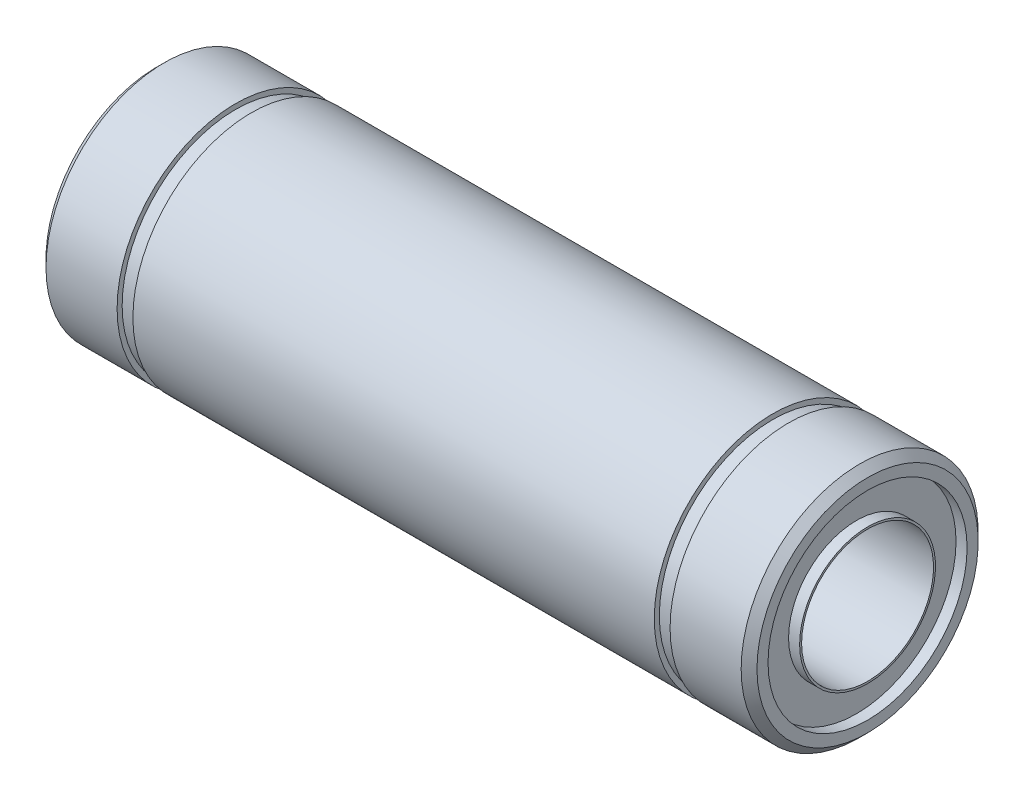
ISO-10303-21;
HEADER;
FILE_DESCRIPTION(('STEP AP214'),'2;1');
FILE_NAME('part.step','',(''),(''),'','','');
FILE_SCHEMA(('AUTOMOTIVE_DESIGN { 1 0 10303 214 1 1 1 1 }'));
ENDSEC;
DATA;
#1=APPLICATION_CONTEXT('core data for automotive mechanical design processes');
#2=APPLICATION_PROTOCOL_DEFINITION('international standard','automotive_design',2000,#1);
#3=PRODUCT_CONTEXT('',#1,'mechanical');
#4=PRODUCT('Part','Part','',(#3));
#5=PRODUCT_RELATED_PRODUCT_CATEGORY('part','',(#4));
#6=PRODUCT_DEFINITION_FORMATION('','',#4);
#7=PRODUCT_DEFINITION_CONTEXT('part definition',#1,'design');
#8=PRODUCT_DEFINITION('design','',#6,#7);
#9=PRODUCT_DEFINITION_SHAPE('','',#8);
#10=(LENGTH_UNIT() NAMED_UNIT(*) SI_UNIT(.MILLI.,.METRE.));
#11=(NAMED_UNIT(*) PLANE_ANGLE_UNIT() SI_UNIT($,.RADIAN.));
#12=(NAMED_UNIT(*) SI_UNIT($,.STERADIAN.) SOLID_ANGLE_UNIT());
#13=UNCERTAINTY_MEASURE_WITH_UNIT(LENGTH_MEASURE(1.E-05),#10,'distance_accuracy_value','');
#14=(GEOMETRIC_REPRESENTATION_CONTEXT(3) GLOBAL_UNCERTAINTY_ASSIGNED_CONTEXT((#13)) GLOBAL_UNIT_ASSIGNED_CONTEXT((#10,
#11,#12)) REPRESENTATION_CONTEXT('',''));
#15=CARTESIAN_POINT('',(0.,0.,0.));
#16=DIRECTION('',(0.,0.,1.));
#17=DIRECTION('',(1.,0.,0.));
#18=AXIS2_PLACEMENT_3D('',#15,#16,#17);
#19=CARTESIAN_POINT('',(0.,7.5,0.));
#20=DIRECTION('',(1.,0.,0.));
#21=DIRECTION('',(0.,0.,-1.));
#22=AXIS2_PLACEMENT_3D('',#19,#20,#21);
#23=PLANE('',#22);
#24=CARTESIAN_POINT('',(0.,0.,0.));
#25=DIRECTION('',(1.,0.,0.));
#26=DIRECTION('',(0.,0.,-1.));
#27=AXIS2_PLACEMENT_3D('',#24,#25,#26);
#28=CIRCLE('',#27,7.);
#29=CARTESIAN_POINT('',(0.,0.,-7.));
#30=VERTEX_POINT('',#29);
#31=EDGE_CURVE('E48',#30,#30,#28,.F.);
#32=ORIENTED_EDGE('',*,*,#31,.T.);
#33=EDGE_LOOP('',(#32));
#34=FACE_BOUND('',#33,.T.);
#35=CARTESIAN_POINT('',(0.,0.,0.));
#36=DIRECTION('',(-1.,0.,0.));
#37=DIRECTION('',(0.,0.,1.));
#38=AXIS2_PLACEMENT_3D('',#35,#36,#37);
#39=CIRCLE('',#38,6.3);
#40=CARTESIAN_POINT('',(0.,0.,6.3));
#41=VERTEX_POINT('',#40);
#42=EDGE_CURVE('E61',#41,#41,#39,.T.);
#43=ORIENTED_EDGE('',*,*,#42,.F.);
#44=EDGE_LOOP('',(#43));
#45=FACE_BOUND('',#44,.T.);
#46=ADVANCED_FACE('F41',(#34,#45),#23,.F.);
#47=CARTESIAN_POINT('',(0.,0.,0.));
#48=DIRECTION('',(-1.,0.,0.));
#49=DIRECTION('',(0.,0.,1.));
#50=AXIS2_PLACEMENT_3D('',#47,#48,#49);
#51=CYLINDRICAL_SURFACE('',#50,6.3);
#52=CARTESIAN_POINT('',(0.7,0.,0.));
#53=DIRECTION('',(-1.,0.,0.));
#54=DIRECTION('',(0.,0.,1.));
#55=AXIS2_PLACEMENT_3D('',#52,#53,#54);
#56=CIRCLE('',#55,6.3);
#57=CARTESIAN_POINT('',(0.7,0.,6.3));
#58=VERTEX_POINT('',#57);
#59=EDGE_CURVE('E64',#58,#58,#56,.T.);
#60=ORIENTED_EDGE('',*,*,#59,.F.);
#61=EDGE_LOOP('',(#60));
#62=FACE_BOUND('',#61,.T.);
#63=ORIENTED_EDGE('',*,*,#42,.T.);
#64=EDGE_LOOP('',(#63));
#65=FACE_BOUND('',#64,.T.);
#66=ADVANCED_FACE('F173',(#62,#65),#51,.F.);
#67=CARTESIAN_POINT('',(0.7,6.3,0.));
#68=DIRECTION('',(1.,0.,0.));
#69=DIRECTION('',(0.,0.,-1.));
#70=AXIS2_PLACEMENT_3D('',#67,#68,#69);
#71=PLANE('',#70);
#72=CARTESIAN_POINT('',(0.7,0.,0.));
#73=DIRECTION('',(-1.,0.,0.));
#74=DIRECTION('',(0.,0.,1.));
#75=AXIS2_PLACEMENT_3D('',#72,#73,#74);
#76=CIRCLE('',#75,4.3);
#77=CARTESIAN_POINT('',(0.7,0.,4.3));
#78=VERTEX_POINT('',#77);
#79=EDGE_CURVE('E67',#78,#78,#76,.T.);
#80=ORIENTED_EDGE('',*,*,#79,.F.);
#81=EDGE_LOOP('',(#80));
#82=FACE_BOUND('',#81,.T.);
#83=ORIENTED_EDGE('',*,*,#59,.T.);
#84=EDGE_LOOP('',(#83));
#85=FACE_BOUND('',#84,.T.);
#86=ADVANCED_FACE('F179',(#82,#85),#71,.F.);
#87=CARTESIAN_POINT('',(0.,0.,0.));
#88=DIRECTION('',(-1.,0.,0.));
#89=DIRECTION('',(0.,0.,1.));
#90=AXIS2_PLACEMENT_3D('',#87,#88,#89);
#91=CYLINDRICAL_SURFACE('',#90,4.3);
#92=CARTESIAN_POINT('',(0.,0.,0.));
#93=DIRECTION('',(-1.,0.,0.));
#94=DIRECTION('',(0.,0.,1.));
#95=AXIS2_PLACEMENT_3D('',#92,#93,#94);
#96=CIRCLE('',#95,4.3);
#97=CARTESIAN_POINT('',(0.,0.,4.3));
#98=VERTEX_POINT('',#97);
#99=EDGE_CURVE('E70',#98,#98,#96,.T.);
#100=ORIENTED_EDGE('',*,*,#99,.F.);
#101=EDGE_LOOP('',(#100));
#102=FACE_BOUND('',#101,.T.);
#103=ORIENTED_EDGE('',*,*,#79,.T.);
#104=EDGE_LOOP('',(#103));
#105=FACE_BOUND('',#104,.T.);
#106=ADVANCED_FACE('F230',(#102,#105),#91,.T.);
#107=CARTESIAN_POINT('',(0.,4.3,0.));
#108=DIRECTION('',(1.,0.,0.));
#109=DIRECTION('',(0.,0.,-1.));
#110=AXIS2_PLACEMENT_3D('',#107,#108,#109);
#111=PLANE('',#110);
#112=CARTESIAN_POINT('',(0.,0.,0.));
#113=DIRECTION('',(-1.,0.,0.));
#114=DIRECTION('',(0.,0.,1.));
#115=AXIS2_PLACEMENT_3D('',#112,#113,#114);
#116=CIRCLE('',#115,4.175);
#117=CARTESIAN_POINT('',(0.,0.,4.175));
#118=VERTEX_POINT('',#117);
#119=EDGE_CURVE('E73',#118,#118,#116,.T.);
#120=ORIENTED_EDGE('',*,*,#119,.F.);
#121=EDGE_LOOP('',(#120));
#122=FACE_BOUND('',#121,.T.);
#123=ORIENTED_EDGE('',*,*,#99,.T.);
#124=EDGE_LOOP('',(#123));
#125=FACE_BOUND('',#124,.T.);
#126=ADVANCED_FACE('F224',(#122,#125),#111,.F.);
#127=CARTESIAN_POINT('',(0.,0.,0.));
#128=DIRECTION('',(-1.,0.,0.));
#129=DIRECTION('',(0.,0.,1.));
#130=AXIS2_PLACEMENT_3D('',#127,#128,#129);
#131=CYLINDRICAL_SURFACE('',#130,4.175);
#132=CARTESIAN_POINT('',(45.,0.,0.));
#133=DIRECTION('',(-1.,0.,0.));
#134=DIRECTION('',(0.,0.,1.));
#135=AXIS2_PLACEMENT_3D('',#132,#133,#134);
#136=CIRCLE('',#135,4.175);
#137=CARTESIAN_POINT('',(45.,0.,4.175));
#138=VERTEX_POINT('',#137);
#139=EDGE_CURVE('E76',#138,#138,#136,.T.);
#140=ORIENTED_EDGE('',*,*,#139,.F.);
#141=EDGE_LOOP('',(#140));
#142=FACE_BOUND('',#141,.T.);
#143=ORIENTED_EDGE('',*,*,#119,.T.);
#144=EDGE_LOOP('',(#143));
#145=FACE_BOUND('',#144,.T.);
#146=ADVANCED_FACE('F218',(#142,#145),#131,.F.);
#147=CARTESIAN_POINT('',(45.,4.3,0.));
#148=DIRECTION('',(-1.,0.,0.));
#149=DIRECTION('',(0.,0.,1.));
#150=AXIS2_PLACEMENT_3D('',#147,#148,#149);
#151=PLANE('',#150);
#152=CARTESIAN_POINT('',(45.,0.,0.));
#153=DIRECTION('',(-1.,0.,0.));
#154=DIRECTION('',(0.,0.,1.));
#155=AXIS2_PLACEMENT_3D('',#152,#153,#154);
#156=CIRCLE('',#155,4.3);
#157=CARTESIAN_POINT('',(45.,0.,4.3));
#158=VERTEX_POINT('',#157);
#159=EDGE_CURVE('E79',#158,#158,#156,.T.);
#160=ORIENTED_EDGE('',*,*,#159,.F.);
#161=EDGE_LOOP('',(#160));
#162=FACE_BOUND('',#161,.T.);
#163=ORIENTED_EDGE('',*,*,#139,.T.);
#164=EDGE_LOOP('',(#163));
#165=FACE_BOUND('',#164,.T.);
#166=ADVANCED_FACE('F212',(#162,#165),#151,.F.);
#167=CARTESIAN_POINT('',(0.,0.,0.));
#168=DIRECTION('',(-1.,0.,0.));
#169=DIRECTION('',(0.,0.,1.));
#170=AXIS2_PLACEMENT_3D('',#167,#168,#169);
#171=CYLINDRICAL_SURFACE('',#170,4.3);
#172=CARTESIAN_POINT('',(44.3,0.,0.));
#173=DIRECTION('',(-1.,0.,0.));
#174=DIRECTION('',(0.,0.,1.));
#175=AXIS2_PLACEMENT_3D('',#172,#173,#174);
#176=CIRCLE('',#175,4.3);
#177=CARTESIAN_POINT('',(44.3,0.,4.3));
#178=VERTEX_POINT('',#177);
#179=EDGE_CURVE('E82',#178,#178,#176,.T.);
#180=ORIENTED_EDGE('',*,*,#179,.F.);
#181=EDGE_LOOP('',(#180));
#182=FACE_BOUND('',#181,.T.);
#183=ORIENTED_EDGE('',*,*,#159,.T.);
#184=EDGE_LOOP('',(#183));
#185=FACE_BOUND('',#184,.T.);
#186=ADVANCED_FACE('F206',(#182,#185),#171,.T.);
#187=CARTESIAN_POINT('',(44.3,6.3,0.));
#188=DIRECTION('',(-1.,0.,0.));
#189=DIRECTION('',(0.,0.,1.));
#190=AXIS2_PLACEMENT_3D('',#187,#188,#189);
#191=PLANE('',#190);
#192=CARTESIAN_POINT('',(44.3,0.,0.));
#193=DIRECTION('',(-1.,0.,0.));
#194=DIRECTION('',(0.,0.,1.));
#195=AXIS2_PLACEMENT_3D('',#192,#193,#194);
#196=CIRCLE('',#195,6.3);
#197=CARTESIAN_POINT('',(44.3,0.,6.3));
#198=VERTEX_POINT('',#197);
#199=EDGE_CURVE('E85',#198,#198,#196,.T.);
#200=ORIENTED_EDGE('',*,*,#199,.F.);
#201=EDGE_LOOP('',(#200));
#202=FACE_BOUND('',#201,.T.);
#203=ORIENTED_EDGE('',*,*,#179,.T.);
#204=EDGE_LOOP('',(#203));
#205=FACE_BOUND('',#204,.T.);
#206=ADVANCED_FACE('F200',(#202,#205),#191,.F.);
#207=CARTESIAN_POINT('',(0.,0.,0.));
#208=DIRECTION('',(-1.,0.,0.));
#209=DIRECTION('',(0.,0.,1.));
#210=AXIS2_PLACEMENT_3D('',#207,#208,#209);
#211=CYLINDRICAL_SURFACE('',#210,6.3);
#212=CARTESIAN_POINT('',(45.,0.,0.));
#213=DIRECTION('',(-1.,0.,0.));
#214=DIRECTION('',(0.,0.,1.));
#215=AXIS2_PLACEMENT_3D('',#212,#213,#214);
#216=CIRCLE('',#215,6.3);
#217=CARTESIAN_POINT('',(45.,0.,6.3));
#218=VERTEX_POINT('',#217);
#219=EDGE_CURVE('E88',#218,#218,#216,.T.);
#220=ORIENTED_EDGE('',*,*,#219,.F.);
#221=EDGE_LOOP('',(#220));
#222=FACE_BOUND('',#221,.T.);
#223=ORIENTED_EDGE('',*,*,#199,.T.);
#224=EDGE_LOOP('',(#223));
#225=FACE_BOUND('',#224,.T.);
#226=ADVANCED_FACE('F169',(#222,#225),#211,.F.);
#227=CARTESIAN_POINT('',(45.,7.5,0.));
#228=DIRECTION('',(-1.,0.,0.));
#229=DIRECTION('',(0.,0.,1.));
#230=AXIS2_PLACEMENT_3D('',#227,#228,#229);
#231=PLANE('',#230);
#232=CARTESIAN_POINT('',(45.,0.,0.));
#233=DIRECTION('',(-1.,0.,0.));
#234=DIRECTION('',(0.,0.,1.));
#235=AXIS2_PLACEMENT_3D('',#232,#233,#234);
#236=CIRCLE('',#235,7.00000000000001);
#237=CARTESIAN_POINT('',(45.,0.,7.00000000000001));
#238=VERTEX_POINT('',#237);
#239=EDGE_CURVE('E52',#238,#238,#236,.F.);
#240=ORIENTED_EDGE('',*,*,#239,.T.);
#241=EDGE_LOOP('',(#240));
#242=FACE_BOUND('',#241,.T.);
#243=ORIENTED_EDGE('',*,*,#219,.T.);
#244=EDGE_LOOP('',(#243));
#245=FACE_BOUND('',#244,.T.);
#246=ADVANCED_FACE('F162',(#242,#245),#231,.F.);
#247=CARTESIAN_POINT('',(0.,0.,0.));
#248=DIRECTION('',(-1.,0.,0.));
#249=DIRECTION('',(0.,0.,1.));
#250=AXIS2_PLACEMENT_3D('',#247,#248,#249);
#251=CYLINDRICAL_SURFACE('',#250,7.5);
#252=CARTESIAN_POINT('',(44.5,0.,0.));
#253=DIRECTION('',(-1.,0.,0.));
#254=DIRECTION('',(0.,0.,1.));
#255=AXIS2_PLACEMENT_3D('',#252,#253,#254);
#256=CIRCLE('',#255,7.5);
#257=CARTESIAN_POINT('',(44.5,0.,7.5));
#258=VERTEX_POINT('',#257);
#259=EDGE_CURVE('E56',#258,#258,#256,.T.);
#260=ORIENTED_EDGE('',*,*,#259,.T.);
#261=EDGE_LOOP('',(#260));
#262=FACE_BOUND('',#261,.T.);
#263=CARTESIAN_POINT('',(40.,0.,0.));
#264=DIRECTION('',(-1.,0.,0.));
#265=DIRECTION('',(0.,0.,1.));
#266=AXIS2_PLACEMENT_3D('',#263,#264,#265);
#267=CIRCLE('',#266,7.5);
#268=CARTESIAN_POINT('',(40.,0.,7.5));
#269=VERTEX_POINT('',#268);
#270=EDGE_CURVE('E91',#269,#269,#267,.T.);
#271=ORIENTED_EDGE('',*,*,#270,.F.);
#272=EDGE_LOOP('',(#271));
#273=FACE_BOUND('',#272,.T.);
#274=ADVANCED_FACE('F157',(#262,#273),#251,.T.);
#275=CARTESIAN_POINT('',(40.,7.5,0.));
#276=DIRECTION('',(1.,0.,0.));
#277=DIRECTION('',(0.,0.,-1.));
#278=AXIS2_PLACEMENT_3D('',#275,#276,#277);
#279=PLANE('',#278);
#280=CARTESIAN_POINT('',(40.,0.,0.));
#281=DIRECTION('',(-1.,0.,0.));
#282=DIRECTION('',(0.,0.,1.));
#283=AXIS2_PLACEMENT_3D('',#280,#281,#282);
#284=CIRCLE('',#283,7.18);
#285=CARTESIAN_POINT('',(40.,0.,7.18));
#286=VERTEX_POINT('',#285);
#287=EDGE_CURVE('E94',#286,#286,#284,.T.);
#288=ORIENTED_EDGE('',*,*,#287,.F.);
#289=EDGE_LOOP('',(#288));
#290=FACE_BOUND('',#289,.T.);
#291=ORIENTED_EDGE('',*,*,#270,.T.);
#292=EDGE_LOOP('',(#291));
#293=FACE_BOUND('',#292,.T.);
#294=ADVANCED_FACE('F151',(#290,#293),#279,.F.);
#295=CARTESIAN_POINT('',(0.,0.,0.));
#296=DIRECTION('',(-1.,0.,0.));
#297=DIRECTION('',(0.,0.,1.));
#298=AXIS2_PLACEMENT_3D('',#295,#296,#297);
#299=CYLINDRICAL_SURFACE('',#298,7.18);
#300=CARTESIAN_POINT('',(39.,0.,0.));
#301=DIRECTION('',(-1.,0.,0.));
#302=DIRECTION('',(0.,0.,1.));
#303=AXIS2_PLACEMENT_3D('',#300,#301,#302);
#304=CIRCLE('',#303,7.18);
#305=CARTESIAN_POINT('',(39.,0.,7.18));
#306=VERTEX_POINT('',#305);
#307=EDGE_CURVE('E97',#306,#306,#304,.T.);
#308=ORIENTED_EDGE('',*,*,#307,.F.);
#309=EDGE_LOOP('',(#308));
#310=FACE_BOUND('',#309,.T.);
#311=ORIENTED_EDGE('',*,*,#287,.T.);
#312=EDGE_LOOP('',(#311));
#313=FACE_BOUND('',#312,.T.);
#314=ADVANCED_FACE('F145',(#310,#313),#299,.T.);
#315=CARTESIAN_POINT('',(39.,7.5,0.));
#316=DIRECTION('',(-1.,0.,0.));
#317=DIRECTION('',(0.,0.,1.));
#318=AXIS2_PLACEMENT_3D('',#315,#316,#317);
#319=PLANE('',#318);
#320=CARTESIAN_POINT('',(39.,0.,0.));
#321=DIRECTION('',(-1.,0.,0.));
#322=DIRECTION('',(0.,0.,1.));
#323=AXIS2_PLACEMENT_3D('',#320,#321,#322);
#324=CIRCLE('',#323,7.5);
#325=CARTESIAN_POINT('',(39.,0.,7.5));
#326=VERTEX_POINT('',#325);
#327=EDGE_CURVE('E100',#326,#326,#324,.T.);
#328=ORIENTED_EDGE('',*,*,#327,.F.);
#329=EDGE_LOOP('',(#328));
#330=FACE_BOUND('',#329,.T.);
#331=ORIENTED_EDGE('',*,*,#307,.T.);
#332=EDGE_LOOP('',(#331));
#333=FACE_BOUND('',#332,.T.);
#334=ADVANCED_FACE('F139',(#330,#333),#319,.F.);
#335=CARTESIAN_POINT('',(0.,0.,0.));
#336=DIRECTION('',(-1.,0.,0.));
#337=DIRECTION('',(0.,0.,1.));
#338=AXIS2_PLACEMENT_3D('',#335,#336,#337);
#339=CYLINDRICAL_SURFACE('',#338,7.5);
#340=CARTESIAN_POINT('',(6.,0.,0.));
#341=DIRECTION('',(-1.,0.,0.));
#342=DIRECTION('',(0.,0.,1.));
#343=AXIS2_PLACEMENT_3D('',#340,#341,#342);
#344=CIRCLE('',#343,7.5);
#345=CARTESIAN_POINT('',(6.,0.,7.5));
#346=VERTEX_POINT('',#345);
#347=EDGE_CURVE('E103',#346,#346,#344,.T.);
#348=ORIENTED_EDGE('',*,*,#347,.F.);
#349=EDGE_LOOP('',(#348));
#350=FACE_BOUND('',#349,.T.);
#351=ORIENTED_EDGE('',*,*,#327,.T.);
#352=EDGE_LOOP('',(#351));
#353=FACE_BOUND('',#352,.T.);
#354=ADVANCED_FACE('F133',(#350,#353),#339,.T.);
#355=CARTESIAN_POINT('',(6.,7.5,0.));
#356=DIRECTION('',(1.,0.,0.));
#357=DIRECTION('',(0.,0.,-1.));
#358=AXIS2_PLACEMENT_3D('',#355,#356,#357);
#359=PLANE('',#358);
#360=CARTESIAN_POINT('',(6.,0.,0.));
#361=DIRECTION('',(-1.,0.,0.));
#362=DIRECTION('',(0.,0.,1.));
#363=AXIS2_PLACEMENT_3D('',#360,#361,#362);
#364=CIRCLE('',#363,7.18);
#365=CARTESIAN_POINT('',(6.,0.,7.18));
#366=VERTEX_POINT('',#365);
#367=EDGE_CURVE('E106',#366,#366,#364,.T.);
#368=ORIENTED_EDGE('',*,*,#367,.F.);
#369=EDGE_LOOP('',(#368));
#370=FACE_BOUND('',#369,.T.);
#371=ORIENTED_EDGE('',*,*,#347,.T.);
#372=EDGE_LOOP('',(#371));
#373=FACE_BOUND('',#372,.T.);
#374=ADVANCED_FACE('F127',(#370,#373),#359,.F.);
#375=CARTESIAN_POINT('',(0.,0.,0.));
#376=DIRECTION('',(-1.,0.,0.));
#377=DIRECTION('',(0.,0.,1.));
#378=AXIS2_PLACEMENT_3D('',#375,#376,#377);
#379=CYLINDRICAL_SURFACE('',#378,7.18);
#380=CARTESIAN_POINT('',(5.,0.,0.));
#381=DIRECTION('',(-1.,0.,0.));
#382=DIRECTION('',(0.,0.,1.));
#383=AXIS2_PLACEMENT_3D('',#380,#381,#382);
#384=CIRCLE('',#383,7.18);
#385=CARTESIAN_POINT('',(5.,0.,7.18));
#386=VERTEX_POINT('',#385);
#387=EDGE_CURVE('E109',#386,#386,#384,.T.);
#388=ORIENTED_EDGE('',*,*,#387,.F.);
#389=EDGE_LOOP('',(#388));
#390=FACE_BOUND('',#389,.T.);
#391=ORIENTED_EDGE('',*,*,#367,.T.);
#392=EDGE_LOOP('',(#391));
#393=FACE_BOUND('',#392,.T.);
#394=ADVANCED_FACE('F121',(#390,#393),#379,.T.);
#395=CARTESIAN_POINT('',(5.,7.5,0.));
#396=DIRECTION('',(-1.,0.,0.));
#397=DIRECTION('',(0.,0.,1.));
#398=AXIS2_PLACEMENT_3D('',#395,#396,#397);
#399=PLANE('',#398);
#400=CARTESIAN_POINT('',(5.,0.,0.));
#401=DIRECTION('',(-1.,0.,0.));
#402=DIRECTION('',(0.,0.,1.));
#403=AXIS2_PLACEMENT_3D('',#400,#401,#402);
#404=CIRCLE('',#403,7.5);
#405=CARTESIAN_POINT('',(5.,0.,7.5));
#406=VERTEX_POINT('',#405);
#407=EDGE_CURVE('E112',#406,#406,#404,.T.);
#408=ORIENTED_EDGE('',*,*,#407,.F.);
#409=EDGE_LOOP('',(#408));
#410=FACE_BOUND('',#409,.T.);
#411=ORIENTED_EDGE('',*,*,#387,.T.);
#412=EDGE_LOOP('',(#411));
#413=FACE_BOUND('',#412,.T.);
#414=ADVANCED_FACE('F118',(#410,#413),#399,.F.);
#415=CARTESIAN_POINT('',(0.,0.,0.));
#416=DIRECTION('',(-1.,0.,0.));
#417=DIRECTION('',(0.,0.,1.));
#418=AXIS2_PLACEMENT_3D('',#415,#416,#417);
#419=CYLINDRICAL_SURFACE('',#418,7.5);
#420=CARTESIAN_POINT('',(0.500000000000006,0.,0.));
#421=DIRECTION('',(1.,0.,0.));
#422=DIRECTION('',(0.,0.,-1.));
#423=AXIS2_PLACEMENT_3D('',#420,#421,#422);
#424=CIRCLE('',#423,7.5);
#425=CARTESIAN_POINT('',(0.500000000000006,0.,-7.5));
#426=VERTEX_POINT('',#425);
#427=EDGE_CURVE('E10',#426,#426,#424,.T.);
#428=ORIENTED_EDGE('',*,*,#427,.T.);
#429=EDGE_LOOP('',(#428));
#430=FACE_BOUND('',#429,.T.);
#431=ORIENTED_EDGE('',*,*,#407,.T.);
#432=EDGE_LOOP('',(#431));
#433=FACE_BOUND('',#432,.T.);
#434=ADVANCED_FACE('F116',(#430,#433),#419,.T.);
#435=CARTESIAN_POINT('',(44.5,0.,0.));
#436=DIRECTION('',(-1.,0.,0.));
#437=DIRECTION('',(0.,0.,1.));
#438=AXIS2_PLACEMENT_3D('',#435,#436,#437);
#439=CONICAL_SURFACE('',#438,7.5,0.785398163397446);
#440=ORIENTED_EDGE('',*,*,#239,.F.);
#441=EDGE_LOOP('',(#440));
#442=FACE_BOUND('',#441,.T.);
#443=ORIENTED_EDGE('',*,*,#259,.F.);
#444=EDGE_LOOP('',(#443));
#445=FACE_BOUND('',#444,.T.);
#446=ADVANCED_FACE('F184',(#442,#445),#439,.T.);
#447=CARTESIAN_POINT('',(0.,0.,0.));
#448=DIRECTION('',(1.,0.,0.));
#449=DIRECTION('',(0.,0.,-1.));
#450=AXIS2_PLACEMENT_3D('',#447,#448,#449);
#451=CONICAL_SURFACE('',#450,7.,0.785398163397444);
#452=ORIENTED_EDGE('',*,*,#427,.F.);
#453=EDGE_LOOP('',(#452));
#454=FACE_BOUND('',#453,.T.);
#455=ORIENTED_EDGE('',*,*,#31,.F.);
#456=EDGE_LOOP('',(#455));
#457=FACE_BOUND('',#456,.T.);
#458=ADVANCED_FACE('F43',(#454,#457),#451,.T.);
#459=CLOSED_SHELL('',(#46,#66,#86,#106,#126,#146,#166,#186,#206,#226,#246,#274,#294,#314,#334,
#354,#374,#394,#414,#434,#446,#458));
#460=MANIFOLD_SOLID_BREP('B2',#459);
#461=ADVANCED_BREP_SHAPE_REPRESENTATION('',(#18,#460),#14);
#462=SHAPE_DEFINITION_REPRESENTATION(#9,#461);
ENDSEC;
END-ISO-10303-21;
